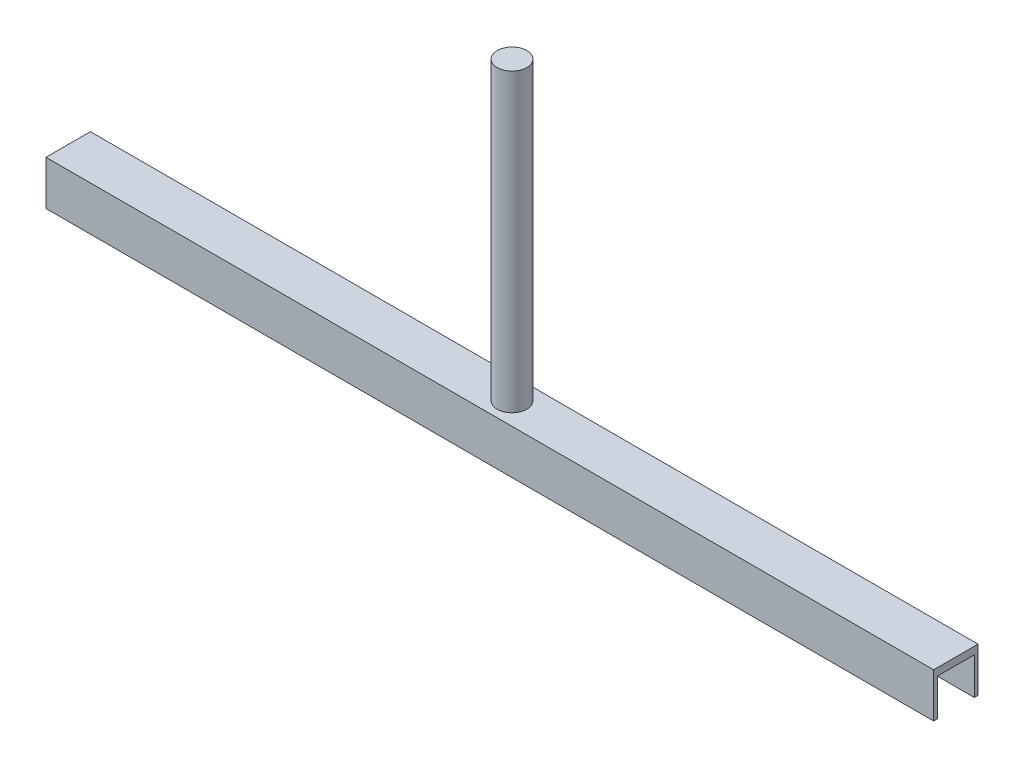
ISO-10303-21;
HEADER;
FILE_DESCRIPTION(('STEP AP214'),'2;1');
FILE_NAME('part.step','',(''),(''),'','','');
FILE_SCHEMA(('AUTOMOTIVE_DESIGN { 1 0 10303 214 1 1 1 1 }'));
ENDSEC;
DATA;
#1=APPLICATION_CONTEXT('core data for automotive mechanical design processes');
#2=APPLICATION_PROTOCOL_DEFINITION('international standard','automotive_design',2000,#1);
#3=PRODUCT_CONTEXT('',#1,'mechanical');
#4=PRODUCT('Part','Part','',(#3));
#5=PRODUCT_RELATED_PRODUCT_CATEGORY('part','',(#4));
#6=PRODUCT_DEFINITION_FORMATION('','',#4);
#7=PRODUCT_DEFINITION_CONTEXT('part definition',#1,'design');
#8=PRODUCT_DEFINITION('design','',#6,#7);
#9=PRODUCT_DEFINITION_SHAPE('','',#8);
#10=(LENGTH_UNIT() NAMED_UNIT(*) SI_UNIT(.MILLI.,.METRE.));
#11=(NAMED_UNIT(*) PLANE_ANGLE_UNIT() SI_UNIT($,.RADIAN.));
#12=(NAMED_UNIT(*) SI_UNIT($,.STERADIAN.) SOLID_ANGLE_UNIT());
#13=UNCERTAINTY_MEASURE_WITH_UNIT(LENGTH_MEASURE(1.E-05),#10,'distance_accuracy_value','');
#14=(GEOMETRIC_REPRESENTATION_CONTEXT(3) GLOBAL_UNCERTAINTY_ASSIGNED_CONTEXT((#13)) GLOBAL_UNIT_ASSIGNED_CONTEXT((#10,
#11,#12)) REPRESENTATION_CONTEXT('',''));
#15=CARTESIAN_POINT('',(0.,0.,0.));
#16=DIRECTION('',(0.,0.,1.));
#17=DIRECTION('',(1.,0.,0.));
#18=AXIS2_PLACEMENT_3D('',#15,#16,#17);
#19=CARTESIAN_POINT('',(-150.,15.,7.50000000000002));
#20=DIRECTION('',(1.,0.,0.));
#21=DIRECTION('',(0.,0.,-1.));
#22=AXIS2_PLACEMENT_3D('',#19,#20,#21);
#23=PLANE('',#22);
#24=DIRECTION('',(0.,-1.,0.));
#25=VECTOR('',#24,1.);
#26=CARTESIAN_POINT('',(-150.,12.5,6.25000000000005));
#27=LINE('',#26,#25);
#28=CARTESIAN_POINT('',(-150.,12.5,6.25000000000005));
#29=VERTEX_POINT('',#28);
#30=CARTESIAN_POINT('',(-150.,0.,6.25000000000005));
#31=VERTEX_POINT('',#30);
#32=EDGE_CURVE('E118',#29,#31,#27,.T.);
#33=ORIENTED_EDGE('',*,*,#32,.T.);
#34=DIRECTION('',(0.,0.,1.));
#35=VECTOR('',#34,1.);
#36=CARTESIAN_POINT('',(-150.,0.,7.50000000000002));
#37=LINE('',#36,#35);
#38=CARTESIAN_POINT('',(-150.,0.,7.50000000000002));
#39=VERTEX_POINT('',#38);
#40=EDGE_CURVE('E124',#31,#39,#37,.T.);
#41=ORIENTED_EDGE('',*,*,#40,.T.);
#42=DIRECTION('',(0.,-1.,0.));
#43=VECTOR('',#42,1.);
#44=CARTESIAN_POINT('',(-150.,15.,7.50000000000002));
#45=LINE('',#44,#43);
#46=CARTESIAN_POINT('',(-150.,15.,7.50000000000002));
#47=VERTEX_POINT('',#46);
#48=EDGE_CURVE('E11',#47,#39,#45,.T.);
#49=ORIENTED_EDGE('',*,*,#48,.F.);
#50=DIRECTION('',(0.,0.,1.));
#51=VECTOR('',#50,1.);
#52=CARTESIAN_POINT('',(-150.,15.,7.50000000000002));
#53=LINE('',#52,#51);
#54=CARTESIAN_POINT('',(-150.,15.,-7.49999999999997));
#55=VERTEX_POINT('',#54);
#56=EDGE_CURVE('E145',#55,#47,#53,.T.);
#57=ORIENTED_EDGE('',*,*,#56,.F.);
#58=DIRECTION('',(0.,-1.,0.));
#59=VECTOR('',#58,1.);
#60=CARTESIAN_POINT('',(-150.,15.,-7.49999999999997));
#61=LINE('',#60,#59);
#62=CARTESIAN_POINT('',(-150.,0.,-7.49999999999997));
#63=VERTEX_POINT('',#62);
#64=EDGE_CURVE('E151',#55,#63,#61,.T.);
#65=ORIENTED_EDGE('',*,*,#64,.T.);
#66=CARTESIAN_POINT('',(-150.,0.,-6.24999999999999));
#67=VERTEX_POINT('',#66);
#68=EDGE_CURVE('E152',#63,#67,#37,.T.);
#69=ORIENTED_EDGE('',*,*,#68,.T.);
#70=DIRECTION('',(0.,-1.,0.));
#71=VECTOR('',#70,1.);
#72=CARTESIAN_POINT('',(-150.,12.5,-6.24999999999998));
#73=LINE('',#72,#71);
#74=CARTESIAN_POINT('',(-150.,12.5,-6.24999999999998));
#75=VERTEX_POINT('',#74);
#76=EDGE_CURVE('E47',#75,#67,#73,.T.);
#77=ORIENTED_EDGE('',*,*,#76,.F.);
#78=DIRECTION('',(0.,0.,1.));
#79=VECTOR('',#78,1.);
#80=CARTESIAN_POINT('',(-150.,12.5,6.25000000000005));
#81=LINE('',#80,#79);
#82=EDGE_CURVE('E111',#75,#29,#81,.T.);
#83=ORIENTED_EDGE('',*,*,#82,.T.);
#84=EDGE_LOOP('',(#33,#41,#49,#57,#65,#69,#77,#83));
#85=FACE_BOUND('',#84,.T.);
#86=ADVANCED_FACE('F33',(#85),#23,.F.);
#87=CARTESIAN_POINT('',(150.,15.,7.49999999999998));
#88=DIRECTION('',(-1.,0.,0.));
#89=DIRECTION('',(0.,0.,1.));
#90=AXIS2_PLACEMENT_3D('',#87,#88,#89);
#91=PLANE('',#90);
#92=DIRECTION('',(0.,-1.,0.));
#93=VECTOR('',#92,1.);
#94=CARTESIAN_POINT('',(150.,12.5,6.24999999999999));
#95=LINE('',#94,#93);
#96=CARTESIAN_POINT('',(150.,12.5,6.24999999999999));
#97=VERTEX_POINT('',#96);
#98=CARTESIAN_POINT('',(150.,0.,6.24999999999999));
#99=VERTEX_POINT('',#98);
#100=EDGE_CURVE('E125',#97,#99,#95,.T.);
#101=ORIENTED_EDGE('',*,*,#100,.F.);
#102=DIRECTION('',(0.,0.,-1.));
#103=VECTOR('',#102,1.);
#104=CARTESIAN_POINT('',(150.,12.5,6.24999999999999));
#105=LINE('',#104,#103);
#106=CARTESIAN_POINT('',(150.,12.5,-6.25000000000001));
#107=VERTEX_POINT('',#106);
#108=EDGE_CURVE('E113',#97,#107,#105,.T.);
#109=ORIENTED_EDGE('',*,*,#108,.T.);
#110=DIRECTION('',(0.,-1.,0.));
#111=VECTOR('',#110,1.);
#112=CARTESIAN_POINT('',(150.,12.5,-6.25000000000001));
#113=LINE('',#112,#111);
#114=CARTESIAN_POINT('',(150.,0.,-6.25000000000001));
#115=VERTEX_POINT('',#114);
#116=EDGE_CURVE('E141',#107,#115,#113,.T.);
#117=ORIENTED_EDGE('',*,*,#116,.T.);
#118=DIRECTION('',(0.,0.,-1.));
#119=VECTOR('',#118,1.);
#120=CARTESIAN_POINT('',(150.,0.,7.49999999999998));
#121=LINE('',#120,#119);
#122=CARTESIAN_POINT('',(150.,0.,-7.50000000000002));
#123=VERTEX_POINT('',#122);
#124=EDGE_CURVE('E156',#115,#123,#121,.T.);
#125=ORIENTED_EDGE('',*,*,#124,.T.);
#126=DIRECTION('',(0.,-1.,0.));
#127=VECTOR('',#126,1.);
#128=CARTESIAN_POINT('',(150.,15.,-7.50000000000002));
#129=LINE('',#128,#127);
#130=CARTESIAN_POINT('',(150.,15.,-7.50000000000002));
#131=VERTEX_POINT('',#130);
#132=EDGE_CURVE('E162',#131,#123,#129,.T.);
#133=ORIENTED_EDGE('',*,*,#132,.F.);
#134=DIRECTION('',(0.,0.,-1.));
#135=VECTOR('',#134,1.);
#136=CARTESIAN_POINT('',(150.,15.,7.49999999999998));
#137=LINE('',#136,#135);
#138=CARTESIAN_POINT('',(150.,15.,7.49999999999998));
#139=VERTEX_POINT('',#138);
#140=EDGE_CURVE('E148',#139,#131,#137,.T.);
#141=ORIENTED_EDGE('',*,*,#140,.F.);
#142=DIRECTION('',(0.,-1.,0.));
#143=VECTOR('',#142,1.);
#144=CARTESIAN_POINT('',(150.,15.,7.49999999999998));
#145=LINE('',#144,#143);
#146=CARTESIAN_POINT('',(150.,0.,7.49999999999998));
#147=VERTEX_POINT('',#146);
#148=EDGE_CURVE('E40',#139,#147,#145,.T.);
#149=ORIENTED_EDGE('',*,*,#148,.T.);
#150=EDGE_CURVE('E157',#147,#99,#121,.T.);
#151=ORIENTED_EDGE('',*,*,#150,.T.);
#152=EDGE_LOOP('',(#101,#109,#117,#125,#133,#141,#149,#151));
#153=FACE_BOUND('',#152,.T.);
#154=ADVANCED_FACE('F167',(#153),#91,.F.);
#155=CARTESIAN_POINT('',(0.,0.,0.));
#156=DIRECTION('',(0.,1.,0.));
#157=DIRECTION('',(0.,0.,1.));
#158=AXIS2_PLACEMENT_3D('',#155,#156,#157);
#159=PLANE('',#158);
#160=DIRECTION('',(1.,0.,0.));
#161=VECTOR('',#160,1.);
#162=CARTESIAN_POINT('',(150.,0.,6.24999999999999));
#163=LINE('',#162,#161);
#164=EDGE_CURVE('E121',#31,#99,#163,.T.);
#165=ORIENTED_EDGE('',*,*,#164,.T.);
#166=ORIENTED_EDGE('',*,*,#150,.F.);
#167=DIRECTION('',(1.,0.,0.));
#168=VECTOR('',#167,1.);
#169=CARTESIAN_POINT('',(150.,0.,7.49999999999998));
#170=LINE('',#169,#168);
#171=EDGE_CURVE('E154',#39,#147,#170,.T.);
#172=ORIENTED_EDGE('',*,*,#171,.F.);
#173=ORIENTED_EDGE('',*,*,#40,.F.);
#174=EDGE_LOOP('',(#165,#166,#172,#173));
#175=FACE_BOUND('',#174,.T.);
#176=ADVANCED_FACE('F171',(#175),#159,.F.);
#177=DIRECTION('',(-1.,0.,0.));
#178=VECTOR('',#177,1.);
#179=CARTESIAN_POINT('',(150.,0.,-6.25000000000001));
#180=LINE('',#179,#178);
#181=EDGE_CURVE('E128',#115,#67,#180,.T.);
#182=ORIENTED_EDGE('',*,*,#181,.T.);
#183=ORIENTED_EDGE('',*,*,#68,.F.);
#184=DIRECTION('',(-1.,0.,0.));
#185=VECTOR('',#184,1.);
#186=CARTESIAN_POINT('',(150.,0.,-7.50000000000002));
#187=LINE('',#186,#185);
#188=EDGE_CURVE('E77',#123,#63,#187,.T.);
#189=ORIENTED_EDGE('',*,*,#188,.F.);
#190=ORIENTED_EDGE('',*,*,#124,.F.);
#191=EDGE_LOOP('',(#182,#183,#189,#190));
#192=FACE_BOUND('',#191,.T.);
#193=ADVANCED_FACE('F177',(#192),#159,.F.);
#194=CARTESIAN_POINT('',(150.,15.,7.49999999999998));
#195=DIRECTION('',(0.,0.,-1.));
#196=DIRECTION('',(-1.,0.,0.));
#197=AXIS2_PLACEMENT_3D('',#194,#195,#196);
#198=PLANE('',#197);
#199=ORIENTED_EDGE('',*,*,#171,.T.);
#200=ORIENTED_EDGE('',*,*,#148,.F.);
#201=DIRECTION('',(1.,0.,0.));
#202=VECTOR('',#201,1.);
#203=CARTESIAN_POINT('',(150.,15.,7.49999999999998));
#204=LINE('',#203,#202);
#205=EDGE_CURVE('E84',#47,#139,#204,.T.);
#206=ORIENTED_EDGE('',*,*,#205,.F.);
#207=ORIENTED_EDGE('',*,*,#48,.T.);
#208=EDGE_LOOP('',(#199,#200,#206,#207));
#209=FACE_BOUND('',#208,.T.);
#210=ADVANCED_FACE('F174',(#209),#198,.F.);
#211=CARTESIAN_POINT('',(150.,15.,-7.50000000000002));
#212=DIRECTION('',(0.,0.,1.));
#213=DIRECTION('',(1.,0.,0.));
#214=AXIS2_PLACEMENT_3D('',#211,#212,#213);
#215=PLANE('',#214);
#216=ORIENTED_EDGE('',*,*,#188,.T.);
#217=ORIENTED_EDGE('',*,*,#64,.F.);
#218=DIRECTION('',(-1.,0.,0.));
#219=VECTOR('',#218,1.);
#220=CARTESIAN_POINT('',(150.,15.,-7.50000000000002));
#221=LINE('',#220,#219);
#222=EDGE_CURVE('E56',#131,#55,#221,.T.);
#223=ORIENTED_EDGE('',*,*,#222,.F.);
#224=ORIENTED_EDGE('',*,*,#132,.T.);
#225=EDGE_LOOP('',(#216,#217,#223,#224));
#226=FACE_BOUND('',#225,.T.);
#227=ADVANCED_FACE('F176',(#226),#215,.F.);
#228=CARTESIAN_POINT('',(0.,15.,0.));
#229=DIRECTION('',(0.,1.,0.));
#230=DIRECTION('',(0.,0.,1.));
#231=AXIS2_PLACEMENT_3D('',#228,#229,#230);
#232=PLANE('',#231);
#233=CARTESIAN_POINT('',(0.,15.,0.));
#234=DIRECTION('',(0.,1.,0.));
#235=DIRECTION('',(0.,0.,1.));
#236=AXIS2_PLACEMENT_3D('',#233,#234,#235);
#237=CIRCLE('',#236,5.);
#238=CARTESIAN_POINT('',(0.,15.,5.));
#239=VERTEX_POINT('',#238);
#240=EDGE_CURVE('E132',#239,#239,#237,.T.);
#241=ORIENTED_EDGE('',*,*,#240,.F.);
#242=EDGE_LOOP('',(#241));
#243=FACE_BOUND('',#242,.T.);
#244=ORIENTED_EDGE('',*,*,#56,.T.);
#245=ORIENTED_EDGE('',*,*,#205,.T.);
#246=ORIENTED_EDGE('',*,*,#140,.T.);
#247=ORIENTED_EDGE('',*,*,#222,.T.);
#248=EDGE_LOOP('',(#244,#245,#246,#247));
#249=FACE_BOUND('',#248,.T.);
#250=ADVANCED_FACE('F182',(#243,#249),#232,.T.);
#251=CARTESIAN_POINT('',(150.,12.5,6.24999999999999));
#252=DIRECTION('',(0.,0.,-1.));
#253=DIRECTION('',(-1.,0.,0.));
#254=AXIS2_PLACEMENT_3D('',#251,#252,#253);
#255=PLANE('',#254);
#256=ORIENTED_EDGE('',*,*,#164,.F.);
#257=ORIENTED_EDGE('',*,*,#32,.F.);
#258=DIRECTION('',(1.,0.,0.));
#259=VECTOR('',#258,1.);
#260=CARTESIAN_POINT('',(150.,12.5,6.24999999999999));
#261=LINE('',#260,#259);
#262=EDGE_CURVE('E106',#29,#97,#261,.T.);
#263=ORIENTED_EDGE('',*,*,#262,.T.);
#264=ORIENTED_EDGE('',*,*,#100,.T.);
#265=EDGE_LOOP('',(#256,#257,#263,#264));
#266=FACE_BOUND('',#265,.T.);
#267=ADVANCED_FACE('F119',(#266),#255,.T.);
#268=CARTESIAN_POINT('',(150.,12.5,-6.25000000000001));
#269=DIRECTION('',(0.,0.,1.));
#270=DIRECTION('',(1.,0.,0.));
#271=AXIS2_PLACEMENT_3D('',#268,#269,#270);
#272=PLANE('',#271);
#273=ORIENTED_EDGE('',*,*,#181,.F.);
#274=ORIENTED_EDGE('',*,*,#116,.F.);
#275=DIRECTION('',(-1.,0.,0.));
#276=VECTOR('',#275,1.);
#277=CARTESIAN_POINT('',(150.,12.5,-6.25000000000001));
#278=LINE('',#277,#276);
#279=EDGE_CURVE('E136',#107,#75,#278,.T.);
#280=ORIENTED_EDGE('',*,*,#279,.T.);
#281=ORIENTED_EDGE('',*,*,#76,.T.);
#282=EDGE_LOOP('',(#273,#274,#280,#281));
#283=FACE_BOUND('',#282,.T.);
#284=ADVANCED_FACE('F200',(#283),#272,.T.);
#285=CARTESIAN_POINT('',(0.,12.5,0.));
#286=DIRECTION('',(0.,1.,0.));
#287=DIRECTION('',(0.,0.,1.));
#288=AXIS2_PLACEMENT_3D('',#285,#286,#287);
#289=PLANE('',#288);
#290=ORIENTED_EDGE('',*,*,#82,.F.);
#291=ORIENTED_EDGE('',*,*,#279,.F.);
#292=ORIENTED_EDGE('',*,*,#108,.F.);
#293=ORIENTED_EDGE('',*,*,#262,.F.);
#294=EDGE_LOOP('',(#290,#291,#292,#293));
#295=FACE_BOUND('',#294,.T.);
#296=ADVANCED_FACE('F108',(#295),#289,.F.);
#297=CARTESIAN_POINT('',(0.,115.,0.));
#298=DIRECTION('',(0.,-1.,0.));
#299=DIRECTION('',(0.,0.,-1.));
#300=AXIS2_PLACEMENT_3D('',#297,#298,#299);
#301=CYLINDRICAL_SURFACE('',#300,5.);
#302=CARTESIAN_POINT('',(0.,115.,0.));
#303=DIRECTION('',(0.,1.,0.));
#304=DIRECTION('',(0.,0.,1.));
#305=AXIS2_PLACEMENT_3D('',#302,#303,#304);
#306=CIRCLE('',#305,5.);
#307=CARTESIAN_POINT('',(0.,115.,5.));
#308=VERTEX_POINT('',#307);
#309=EDGE_CURVE('E138',#308,#308,#306,.T.);
#310=ORIENTED_EDGE('',*,*,#309,.F.);
#311=EDGE_LOOP('',(#310));
#312=FACE_BOUND('',#311,.T.);
#313=ORIENTED_EDGE('',*,*,#240,.T.);
#314=EDGE_LOOP('',(#313));
#315=FACE_BOUND('',#314,.T.);
#316=ADVANCED_FACE('F205',(#312,#315),#301,.T.);
#317=CARTESIAN_POINT('',(0.,115.,0.));
#318=DIRECTION('',(0.,1.,0.));
#319=DIRECTION('',(0.,0.,1.));
#320=AXIS2_PLACEMENT_3D('',#317,#318,#319);
#321=PLANE('',#320);
#322=ORIENTED_EDGE('',*,*,#309,.T.);
#323=EDGE_LOOP('',(#322));
#324=FACE_BOUND('',#323,.T.);
#325=ADVANCED_FACE('F208',(#324),#321,.T.);
#326=CLOSED_SHELL('',(#86,#154,#176,#193,#210,#227,#250,#267,#284,#296,#316,#325));
#327=MANIFOLD_SOLID_BREP('B2',#326);
#328=ADVANCED_BREP_SHAPE_REPRESENTATION('',(#18,#327),#14);
#329=SHAPE_DEFINITION_REPRESENTATION(#9,#328);
ENDSEC;
END-ISO-10303-21;
